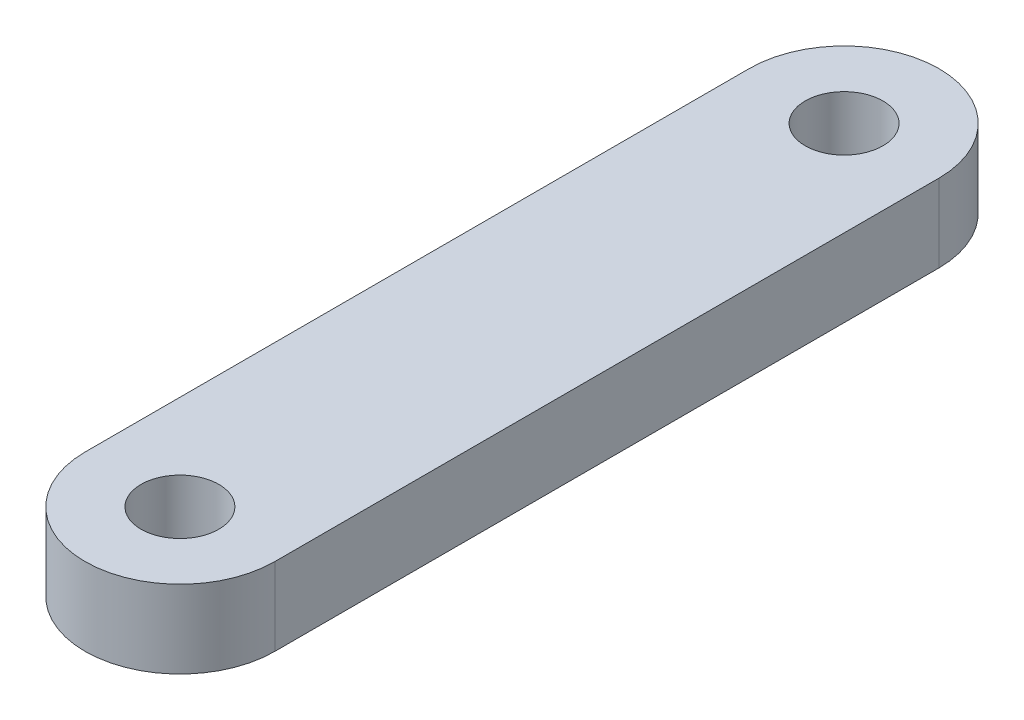
ISO-10303-21;
HEADER;
FILE_DESCRIPTION(('STEP AP214'),'2;1');
FILE_NAME('part.step','',(''),(''),'','','');
FILE_SCHEMA(('AUTOMOTIVE_DESIGN { 1 0 10303 214 1 1 1 1 }'));
ENDSEC;
DATA;
#1=APPLICATION_CONTEXT('core data for automotive mechanical design processes');
#2=APPLICATION_PROTOCOL_DEFINITION('international standard','automotive_design',2000,#1);
#3=PRODUCT_CONTEXT('',#1,'mechanical');
#4=PRODUCT('Part','Part','',(#3));
#5=PRODUCT_RELATED_PRODUCT_CATEGORY('part','',(#4));
#6=PRODUCT_DEFINITION_FORMATION('','',#4);
#7=PRODUCT_DEFINITION_CONTEXT('part definition',#1,'design');
#8=PRODUCT_DEFINITION('design','',#6,#7);
#9=PRODUCT_DEFINITION_SHAPE('','',#8);
#10=(LENGTH_UNIT() NAMED_UNIT(*) SI_UNIT(.MILLI.,.METRE.));
#11=(NAMED_UNIT(*) PLANE_ANGLE_UNIT() SI_UNIT($,.RADIAN.));
#12=(NAMED_UNIT(*) SI_UNIT($,.STERADIAN.) SOLID_ANGLE_UNIT());
#13=UNCERTAINTY_MEASURE_WITH_UNIT(LENGTH_MEASURE(1.E-05),#10,'distance_accuracy_value','');
#14=(GEOMETRIC_REPRESENTATION_CONTEXT(3) GLOBAL_UNCERTAINTY_ASSIGNED_CONTEXT((#13)) GLOBAL_UNIT_ASSIGNED_CONTEXT((#10,
#11,#12)) REPRESENTATION_CONTEXT('',''));
#15=CARTESIAN_POINT('',(0.,0.,0.));
#16=DIRECTION('',(0.,0.,1.));
#17=DIRECTION('',(1.,0.,0.));
#18=AXIS2_PLACEMENT_3D('',#15,#16,#17);
#19=CARTESIAN_POINT('',(0.,4.1656,0.));
#20=DIRECTION('',(0.,1.,0.));
#21=DIRECTION('',(0.,0.,1.));
#22=AXIS2_PLACEMENT_3D('',#19,#20,#21);
#23=PLANE('',#22);
#24=CARTESIAN_POINT('',(0.,4.1656,-35.56));
#25=DIRECTION('',(0.,1.,0.));
#26=DIRECTION('',(0.,0.,1.));
#27=AXIS2_PLACEMENT_3D('',#24,#25,#26);
#28=CIRCLE('',#27,2.0828);
#29=CARTESIAN_POINT('',(0.,4.1656,-33.4772));
#30=VERTEX_POINT('',#29);
#31=EDGE_CURVE('E100',#30,#30,#28,.T.);
#32=ORIENTED_EDGE('',*,*,#31,.F.);
#33=EDGE_LOOP('',(#32));
#34=FACE_BOUND('',#33,.T.);
#35=CARTESIAN_POINT('',(0.,4.1656,0.));
#36=DIRECTION('',(0.,1.,0.));
#37=DIRECTION('',(0.,0.,1.));
#38=AXIS2_PLACEMENT_3D('',#35,#36,#37);
#39=CIRCLE('',#38,5.08);
#40=CARTESIAN_POINT('',(-5.08,4.1656,0.));
#41=VERTEX_POINT('',#40);
#42=CARTESIAN_POINT('',(5.08,4.1656,0.));
#43=VERTEX_POINT('',#42);
#44=EDGE_CURVE('E85',#41,#43,#39,.T.);
#45=ORIENTED_EDGE('',*,*,#44,.T.);
#46=DIRECTION('',(0.,0.,-1.));
#47=VECTOR('',#46,1.);
#48=CARTESIAN_POINT('',(5.08,4.1656,0.));
#49=LINE('',#48,#47);
#50=CARTESIAN_POINT('',(5.08,4.1656,-35.56));
#51=VERTEX_POINT('',#50);
#52=EDGE_CURVE('E80',#43,#51,#49,.T.);
#53=ORIENTED_EDGE('',*,*,#52,.T.);
#54=CARTESIAN_POINT('',(0.,4.1656,-35.56));
#55=DIRECTION('',(0.,1.,0.));
#56=DIRECTION('',(0.,0.,1.));
#57=AXIS2_PLACEMENT_3D('',#54,#55,#56);
#58=CIRCLE('',#57,5.08);
#59=CARTESIAN_POINT('',(-5.08,4.1656,-35.56));
#60=VERTEX_POINT('',#59);
#61=EDGE_CURVE('E83',#51,#60,#58,.T.);
#62=ORIENTED_EDGE('',*,*,#61,.T.);
#63=DIRECTION('',(0.,0.,1.));
#64=VECTOR('',#63,1.);
#65=CARTESIAN_POINT('',(-5.08,4.1656,0.));
#66=LINE('',#65,#64);
#67=EDGE_CURVE('E50',#60,#41,#66,.T.);
#68=ORIENTED_EDGE('',*,*,#67,.T.);
#69=EDGE_LOOP('',(#45,#53,#62,#68));
#70=FACE_BOUND('',#69,.T.);
#71=CARTESIAN_POINT('',(0.,4.1656,0.));
#72=DIRECTION('',(0.,1.,0.));
#73=DIRECTION('',(0.,0.,1.));
#74=AXIS2_PLACEMENT_3D('',#71,#72,#73);
#75=CIRCLE('',#74,2.0828);
#76=CARTESIAN_POINT('',(0.,4.1656,2.0828));
#77=VERTEX_POINT('',#76);
#78=EDGE_CURVE('E115',#77,#77,#75,.T.);
#79=ORIENTED_EDGE('',*,*,#78,.F.);
#80=EDGE_LOOP('',(#79));
#81=FACE_BOUND('',#80,.T.);
#82=ADVANCED_FACE('F33',(#34,#70,#81),#23,.T.);
#83=CARTESIAN_POINT('',(0.,0.,0.));
#84=DIRECTION('',(0.,1.,0.));
#85=DIRECTION('',(0.,0.,1.));
#86=AXIS2_PLACEMENT_3D('',#83,#84,#85);
#87=PLANE('',#86);
#88=CARTESIAN_POINT('',(0.,0.,0.));
#89=DIRECTION('',(0.,1.,0.));
#90=DIRECTION('',(0.,0.,1.));
#91=AXIS2_PLACEMENT_3D('',#88,#89,#90);
#92=CIRCLE('',#91,5.08);
#93=CARTESIAN_POINT('',(-5.08,0.,0.));
#94=VERTEX_POINT('',#93);
#95=CARTESIAN_POINT('',(5.08,0.,0.));
#96=VERTEX_POINT('',#95);
#97=EDGE_CURVE('E97',#94,#96,#92,.T.);
#98=ORIENTED_EDGE('',*,*,#97,.F.);
#99=DIRECTION('',(0.,0.,1.));
#100=VECTOR('',#99,1.);
#101=CARTESIAN_POINT('',(-5.08,0.,0.));
#102=LINE('',#101,#100);
#103=CARTESIAN_POINT('',(-5.08,0.,-35.56));
#104=VERTEX_POINT('',#103);
#105=EDGE_CURVE('E73',#104,#94,#102,.T.);
#106=ORIENTED_EDGE('',*,*,#105,.F.);
#107=CARTESIAN_POINT('',(0.,0.,-35.56));
#108=DIRECTION('',(0.,1.,0.));
#109=DIRECTION('',(0.,0.,1.));
#110=AXIS2_PLACEMENT_3D('',#107,#108,#109);
#111=CIRCLE('',#110,5.08);
#112=CARTESIAN_POINT('',(5.08,0.,-35.56));
#113=VERTEX_POINT('',#112);
#114=EDGE_CURVE('E67',#113,#104,#111,.T.);
#115=ORIENTED_EDGE('',*,*,#114,.F.);
#116=DIRECTION('',(0.,0.,-1.));
#117=VECTOR('',#116,1.);
#118=CARTESIAN_POINT('',(5.08,0.,0.));
#119=LINE('',#118,#117);
#120=EDGE_CURVE('E89',#96,#113,#119,.T.);
#121=ORIENTED_EDGE('',*,*,#120,.F.);
#122=EDGE_LOOP('',(#98,#106,#115,#121));
#123=FACE_BOUND('',#122,.T.);
#124=CARTESIAN_POINT('',(0.,0.,-35.56));
#125=DIRECTION('',(0.,1.,0.));
#126=DIRECTION('',(0.,0.,1.));
#127=AXIS2_PLACEMENT_3D('',#124,#125,#126);
#128=CIRCLE('',#127,2.0828);
#129=CARTESIAN_POINT('',(0.,0.,-33.4772));
#130=VERTEX_POINT('',#129);
#131=EDGE_CURVE('E112',#130,#130,#128,.T.);
#132=ORIENTED_EDGE('',*,*,#131,.T.);
#133=EDGE_LOOP('',(#132));
#134=FACE_BOUND('',#133,.T.);
#135=CARTESIAN_POINT('',(0.,0.,0.));
#136=DIRECTION('',(0.,1.,0.));
#137=DIRECTION('',(0.,0.,1.));
#138=AXIS2_PLACEMENT_3D('',#135,#136,#137);
#139=CIRCLE('',#138,2.0828);
#140=CARTESIAN_POINT('',(0.,0.,2.0828));
#141=VERTEX_POINT('',#140);
#142=EDGE_CURVE('E118',#141,#141,#139,.T.);
#143=ORIENTED_EDGE('',*,*,#142,.T.);
#144=EDGE_LOOP('',(#143));
#145=FACE_BOUND('',#144,.T.);
#146=ADVANCED_FACE('F108',(#123,#134,#145),#87,.F.);
#147=CARTESIAN_POINT('',(0.,4.1656,0.));
#148=DIRECTION('',(0.,-1.,0.));
#149=DIRECTION('',(0.,0.,-1.));
#150=AXIS2_PLACEMENT_3D('',#147,#148,#149);
#151=CYLINDRICAL_SURFACE('',#150,5.08);
#152=ORIENTED_EDGE('',*,*,#97,.T.);
#153=DIRECTION('',(0.,-1.,0.));
#154=VECTOR('',#153,1.);
#155=CARTESIAN_POINT('',(5.08,4.1656,0.));
#156=LINE('',#155,#154);
#157=EDGE_CURVE('E11',#43,#96,#156,.T.);
#158=ORIENTED_EDGE('',*,*,#157,.F.);
#159=ORIENTED_EDGE('',*,*,#44,.F.);
#160=DIRECTION('',(0.,-1.,0.));
#161=VECTOR('',#160,1.);
#162=CARTESIAN_POINT('',(-5.08,4.1656,0.));
#163=LINE('',#162,#161);
#164=EDGE_CURVE('E93',#41,#94,#163,.T.);
#165=ORIENTED_EDGE('',*,*,#164,.T.);
#166=EDGE_LOOP('',(#152,#158,#159,#165));
#167=FACE_BOUND('',#166,.T.);
#168=ADVANCED_FACE('F35',(#167),#151,.T.);
#169=CARTESIAN_POINT('',(5.08,4.1656,0.));
#170=DIRECTION('',(-1.,0.,0.));
#171=DIRECTION('',(0.,0.,1.));
#172=AXIS2_PLACEMENT_3D('',#169,#170,#171);
#173=PLANE('',#172);
#174=ORIENTED_EDGE('',*,*,#120,.T.);
#175=DIRECTION('',(0.,-1.,0.));
#176=VECTOR('',#175,1.);
#177=CARTESIAN_POINT('',(5.08,4.1656,-35.56));
#178=LINE('',#177,#176);
#179=EDGE_CURVE('E42',#51,#113,#178,.T.);
#180=ORIENTED_EDGE('',*,*,#179,.F.);
#181=ORIENTED_EDGE('',*,*,#52,.F.);
#182=ORIENTED_EDGE('',*,*,#157,.T.);
#183=EDGE_LOOP('',(#174,#180,#181,#182));
#184=FACE_BOUND('',#183,.T.);
#185=ADVANCED_FACE('F88',(#184),#173,.F.);
#186=CARTESIAN_POINT('',(0.,4.1656,-35.56));
#187=DIRECTION('',(0.,-1.,0.));
#188=DIRECTION('',(0.,0.,-1.));
#189=AXIS2_PLACEMENT_3D('',#186,#187,#188);
#190=CYLINDRICAL_SURFACE('',#189,5.08);
#191=ORIENTED_EDGE('',*,*,#114,.T.);
#192=DIRECTION('',(0.,-1.,0.));
#193=VECTOR('',#192,1.);
#194=CARTESIAN_POINT('',(-5.08,4.1656,-35.56));
#195=LINE('',#194,#193);
#196=EDGE_CURVE('E90',#60,#104,#195,.T.);
#197=ORIENTED_EDGE('',*,*,#196,.F.);
#198=ORIENTED_EDGE('',*,*,#61,.F.);
#199=ORIENTED_EDGE('',*,*,#179,.T.);
#200=EDGE_LOOP('',(#191,#197,#198,#199));
#201=FACE_BOUND('',#200,.T.);
#202=ADVANCED_FACE('F91',(#201),#190,.T.);
#203=CARTESIAN_POINT('',(-5.08,4.1656,0.));
#204=DIRECTION('',(1.,0.,0.));
#205=DIRECTION('',(0.,0.,-1.));
#206=AXIS2_PLACEMENT_3D('',#203,#204,#205);
#207=PLANE('',#206);
#208=ORIENTED_EDGE('',*,*,#105,.T.);
#209=ORIENTED_EDGE('',*,*,#164,.F.);
#210=ORIENTED_EDGE('',*,*,#67,.F.);
#211=ORIENTED_EDGE('',*,*,#196,.T.);
#212=EDGE_LOOP('',(#208,#209,#210,#211));
#213=FACE_BOUND('',#212,.T.);
#214=ADVANCED_FACE('F105',(#213),#207,.F.);
#215=CARTESIAN_POINT('',(0.,4.1656,-35.56));
#216=DIRECTION('',(0.,-1.,0.));
#217=DIRECTION('',(0.,0.,-1.));
#218=AXIS2_PLACEMENT_3D('',#215,#216,#217);
#219=CYLINDRICAL_SURFACE('',#218,2.0828);
#220=ORIENTED_EDGE('',*,*,#31,.T.);
#221=EDGE_LOOP('',(#220));
#222=FACE_BOUND('',#221,.T.);
#223=ORIENTED_EDGE('',*,*,#131,.F.);
#224=EDGE_LOOP('',(#223));
#225=FACE_BOUND('',#224,.T.);
#226=ADVANCED_FACE('F135',(#222,#225),#219,.F.);
#227=CARTESIAN_POINT('',(0.,4.1656,0.));
#228=DIRECTION('',(0.,-1.,0.));
#229=DIRECTION('',(0.,0.,-1.));
#230=AXIS2_PLACEMENT_3D('',#227,#228,#229);
#231=CYLINDRICAL_SURFACE('',#230,2.0828);
#232=ORIENTED_EDGE('',*,*,#78,.T.);
#233=EDGE_LOOP('',(#232));
#234=FACE_BOUND('',#233,.T.);
#235=ORIENTED_EDGE('',*,*,#142,.F.);
#236=EDGE_LOOP('',(#235));
#237=FACE_BOUND('',#236,.T.);
#238=ADVANCED_FACE('F124',(#234,#237),#231,.F.);
#239=CLOSED_SHELL('',(#82,#146,#168,#185,#202,#214,#226,#238));
#240=MANIFOLD_SOLID_BREP('B2',#239);
#241=ADVANCED_BREP_SHAPE_REPRESENTATION('',(#18,#240),#14);
#242=SHAPE_DEFINITION_REPRESENTATION(#9,#241);
ENDSEC;
END-ISO-10303-21;
